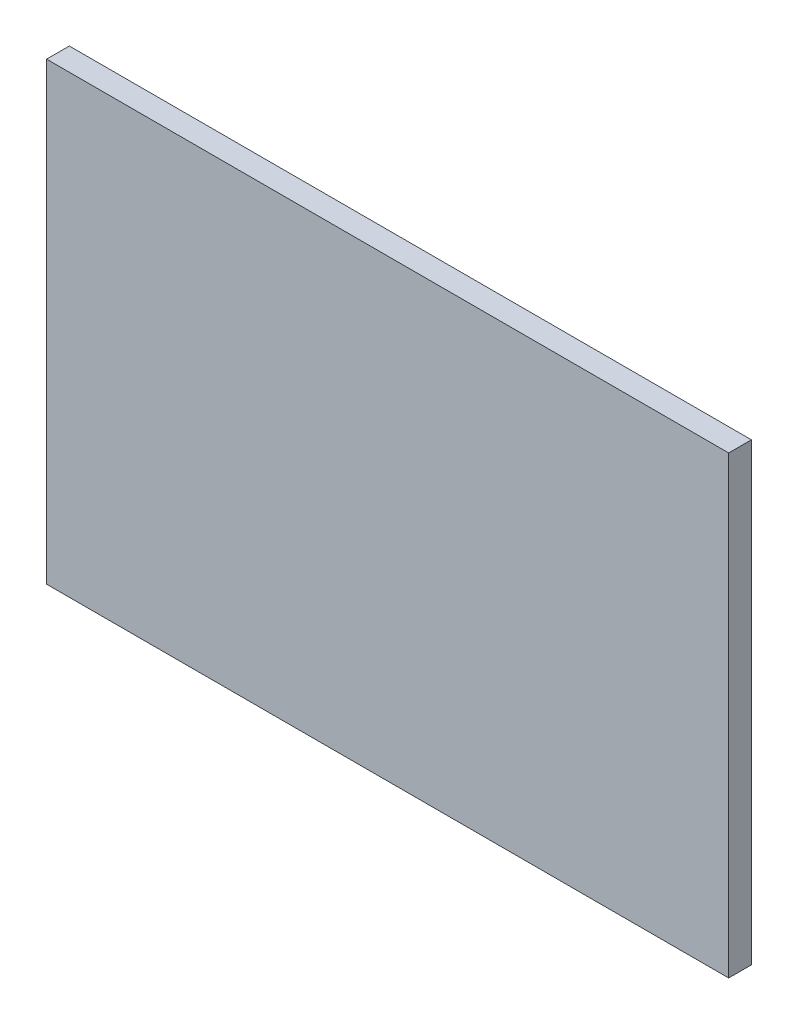
ISO-10303-21;
HEADER;
FILE_DESCRIPTION(('STEP AP214'),'2;1');
FILE_NAME('part.step','',(''),(''),'','','');
FILE_SCHEMA(('AUTOMOTIVE_DESIGN { 1 0 10303 214 1 1 1 1 }'));
ENDSEC;
DATA;
#1=APPLICATION_CONTEXT('core data for automotive mechanical design processes');
#2=APPLICATION_PROTOCOL_DEFINITION('international standard','automotive_design',2000,#1);
#3=PRODUCT_CONTEXT('',#1,'mechanical');
#4=PRODUCT('Part','Part','',(#3));
#5=PRODUCT_RELATED_PRODUCT_CATEGORY('part','',(#4));
#6=PRODUCT_DEFINITION_FORMATION('','',#4);
#7=PRODUCT_DEFINITION_CONTEXT('part definition',#1,'design');
#8=PRODUCT_DEFINITION('design','',#6,#7);
#9=PRODUCT_DEFINITION_SHAPE('','',#8);
#10=(LENGTH_UNIT() NAMED_UNIT(*) SI_UNIT(.MILLI.,.METRE.));
#11=(NAMED_UNIT(*) PLANE_ANGLE_UNIT() SI_UNIT($,.RADIAN.));
#12=(NAMED_UNIT(*) SI_UNIT($,.STERADIAN.) SOLID_ANGLE_UNIT());
#13=UNCERTAINTY_MEASURE_WITH_UNIT(LENGTH_MEASURE(1.E-05),#10,'distance_accuracy_value','');
#14=(GEOMETRIC_REPRESENTATION_CONTEXT(3) GLOBAL_UNCERTAINTY_ASSIGNED_CONTEXT((#13)) GLOBAL_UNIT_ASSIGNED_CONTEXT((#10,
#11,#12)) REPRESENTATION_CONTEXT('',''));
#15=CARTESIAN_POINT('',(0.,0.,0.));
#16=DIRECTION('',(0.,0.,1.));
#17=DIRECTION('',(1.,0.,0.));
#18=AXIS2_PLACEMENT_3D('',#15,#16,#17);
#19=CARTESIAN_POINT('',(-72.2025479526639,35.0321658778279,1.));
#20=DIRECTION('',(1.,0.,0.));
#21=DIRECTION('',(0.,0.,-1.));
#22=AXIS2_PLACEMENT_3D('',#19,#20,#21);
#23=PLANE('',#22);
#24=DIRECTION('',(0.,-1.,0.));
#25=VECTOR('',#24,1.);
#26=CARTESIAN_POINT('',(-72.2025479526639,35.0321658778279,0.));
#27=LINE('',#26,#25);
#28=CARTESIAN_POINT('',(-72.2025479526639,35.0321658778279,0.));
#29=VERTEX_POINT('',#28);
#30=CARTESIAN_POINT('',(-72.2025479526639,15.0321658778279,0.));
#31=VERTEX_POINT('',#30);
#32=EDGE_CURVE('E96',#29,#31,#27,.T.);
#33=ORIENTED_EDGE('',*,*,#32,.T.);
#34=DIRECTION('',(0.,0.,-1.));
#35=VECTOR('',#34,1.);
#36=CARTESIAN_POINT('',(-72.2025479526639,15.0321658778279,1.));
#37=LINE('',#36,#35);
#38=CARTESIAN_POINT('',(-72.2025479526639,15.0321658778279,1.));
#39=VERTEX_POINT('',#38);
#40=EDGE_CURVE('E11',#39,#31,#37,.T.);
#41=ORIENTED_EDGE('',*,*,#40,.F.);
#42=DIRECTION('',(0.,-1.,0.));
#43=VECTOR('',#42,1.);
#44=CARTESIAN_POINT('',(-72.2025479526639,35.0321658778279,1.));
#45=LINE('',#44,#43);
#46=CARTESIAN_POINT('',(-72.2025479526639,35.0321658778279,1.));
#47=VERTEX_POINT('',#46);
#48=EDGE_CURVE('E84',#47,#39,#45,.T.);
#49=ORIENTED_EDGE('',*,*,#48,.F.);
#50=DIRECTION('',(0.,0.,-1.));
#51=VECTOR('',#50,1.);
#52=CARTESIAN_POINT('',(-72.2025479526639,35.0321658778279,1.));
#53=LINE('',#52,#51);
#54=EDGE_CURVE('E92',#47,#29,#53,.T.);
#55=ORIENTED_EDGE('',*,*,#54,.T.);
#56=EDGE_LOOP('',(#33,#41,#49,#55));
#57=FACE_BOUND('',#56,.T.);
#58=ADVANCED_FACE('F33',(#57),#23,.F.);
#59=CARTESIAN_POINT('',(-72.2025479526639,15.0321658778279,1.));
#60=DIRECTION('',(0.,1.,0.));
#61=DIRECTION('',(0.,0.,1.));
#62=AXIS2_PLACEMENT_3D('',#59,#60,#61);
#63=PLANE('',#62);
#64=DIRECTION('',(1.,0.,0.));
#65=VECTOR('',#64,1.);
#66=CARTESIAN_POINT('',(-72.2025479526639,15.0321658778279,0.));
#67=LINE('',#66,#65);
#68=CARTESIAN_POINT('',(-42.2025479526639,15.0321658778279,0.));
#69=VERTEX_POINT('',#68);
#70=EDGE_CURVE('E88',#31,#69,#67,.T.);
#71=ORIENTED_EDGE('',*,*,#70,.T.);
#72=DIRECTION('',(0.,0.,-1.));
#73=VECTOR('',#72,1.);
#74=CARTESIAN_POINT('',(-42.2025479526639,15.0321658778279,1.));
#75=LINE('',#74,#73);
#76=CARTESIAN_POINT('',(-42.2025479526639,15.0321658778279,1.));
#77=VERTEX_POINT('',#76);
#78=EDGE_CURVE('E41',#77,#69,#75,.T.);
#79=ORIENTED_EDGE('',*,*,#78,.F.);
#80=DIRECTION('',(1.,0.,0.));
#81=VECTOR('',#80,1.);
#82=CARTESIAN_POINT('',(-72.2025479526639,15.0321658778279,1.));
#83=LINE('',#82,#81);
#84=EDGE_CURVE('E79',#39,#77,#83,.T.);
#85=ORIENTED_EDGE('',*,*,#84,.F.);
#86=ORIENTED_EDGE('',*,*,#40,.T.);
#87=EDGE_LOOP('',(#71,#79,#85,#86));
#88=FACE_BOUND('',#87,.T.);
#89=ADVANCED_FACE('F87',(#88),#63,.F.);
#90=CARTESIAN_POINT('',(-42.2025479526639,35.0321658778279,1.));
#91=DIRECTION('',(-1.,0.,0.));
#92=DIRECTION('',(0.,0.,1.));
#93=AXIS2_PLACEMENT_3D('',#90,#91,#92);
#94=PLANE('',#93);
#95=DIRECTION('',(0.,1.,0.));
#96=VECTOR('',#95,1.);
#97=CARTESIAN_POINT('',(-42.2025479526639,35.0321658778279,0.));
#98=LINE('',#97,#96);
#99=CARTESIAN_POINT('',(-42.2025479526639,35.0321658778279,0.));
#100=VERTEX_POINT('',#99);
#101=EDGE_CURVE('E66',#69,#100,#98,.T.);
#102=ORIENTED_EDGE('',*,*,#101,.T.);
#103=DIRECTION('',(0.,0.,-1.));
#104=VECTOR('',#103,1.);
#105=CARTESIAN_POINT('',(-42.2025479526639,35.0321658778279,1.));
#106=LINE('',#105,#104);
#107=CARTESIAN_POINT('',(-42.2025479526639,35.0321658778279,1.));
#108=VERTEX_POINT('',#107);
#109=EDGE_CURVE('E89',#108,#100,#106,.T.);
#110=ORIENTED_EDGE('',*,*,#109,.F.);
#111=DIRECTION('',(0.,1.,0.));
#112=VECTOR('',#111,1.);
#113=CARTESIAN_POINT('',(-42.2025479526639,35.0321658778279,1.));
#114=LINE('',#113,#112);
#115=EDGE_CURVE('E82',#77,#108,#114,.T.);
#116=ORIENTED_EDGE('',*,*,#115,.F.);
#117=ORIENTED_EDGE('',*,*,#78,.T.);
#118=EDGE_LOOP('',(#102,#110,#116,#117));
#119=FACE_BOUND('',#118,.T.);
#120=ADVANCED_FACE('F90',(#119),#94,.F.);
#121=CARTESIAN_POINT('',(-72.2025479526639,35.0321658778279,1.));
#122=DIRECTION('',(0.,-1.,0.));
#123=DIRECTION('',(0.,0.,-1.));
#124=AXIS2_PLACEMENT_3D('',#121,#122,#123);
#125=PLANE('',#124);
#126=DIRECTION('',(-1.,0.,0.));
#127=VECTOR('',#126,1.);
#128=CARTESIAN_POINT('',(-72.2025479526639,35.0321658778279,0.));
#129=LINE('',#128,#127);
#130=EDGE_CURVE('E72',#100,#29,#129,.T.);
#131=ORIENTED_EDGE('',*,*,#130,.T.);
#132=ORIENTED_EDGE('',*,*,#54,.F.);
#133=DIRECTION('',(-1.,0.,0.));
#134=VECTOR('',#133,1.);
#135=CARTESIAN_POINT('',(-72.2025479526639,35.0321658778279,1.));
#136=LINE('',#135,#134);
#137=EDGE_CURVE('E49',#108,#47,#136,.T.);
#138=ORIENTED_EDGE('',*,*,#137,.F.);
#139=ORIENTED_EDGE('',*,*,#109,.T.);
#140=EDGE_LOOP('',(#131,#132,#138,#139));
#141=FACE_BOUND('',#140,.T.);
#142=ADVANCED_FACE('F103',(#141),#125,.F.);
#143=CARTESIAN_POINT('',(0.,0.,1.));
#144=DIRECTION('',(0.,0.,1.));
#145=DIRECTION('',(1.,0.,0.));
#146=AXIS2_PLACEMENT_3D('',#143,#144,#145);
#147=PLANE('',#146);
#148=ORIENTED_EDGE('',*,*,#48,.T.);
#149=ORIENTED_EDGE('',*,*,#84,.T.);
#150=ORIENTED_EDGE('',*,*,#115,.T.);
#151=ORIENTED_EDGE('',*,*,#137,.T.);
#152=EDGE_LOOP('',(#148,#149,#150,#151));
#153=FACE_BOUND('',#152,.T.);
#154=ADVANCED_FACE('F80',(#153),#147,.T.);
#155=CARTESIAN_POINT('',(0.,0.,0.));
#156=DIRECTION('',(0.,0.,1.));
#157=DIRECTION('',(1.,0.,0.));
#158=AXIS2_PLACEMENT_3D('',#155,#156,#157);
#159=PLANE('',#158);
#160=ORIENTED_EDGE('',*,*,#32,.F.);
#161=ORIENTED_EDGE('',*,*,#130,.F.);
#162=ORIENTED_EDGE('',*,*,#101,.F.);
#163=ORIENTED_EDGE('',*,*,#70,.F.);
#164=EDGE_LOOP('',(#160,#161,#162,#163));
#165=FACE_BOUND('',#164,.T.);
#166=ADVANCED_FACE('F106',(#165),#159,.F.);
#167=CLOSED_SHELL('',(#58,#89,#120,#142,#154,#166));
#168=MANIFOLD_SOLID_BREP('B2',#167);
#169=ADVANCED_BREP_SHAPE_REPRESENTATION('',(#18,#168),#14);
#170=SHAPE_DEFINITION_REPRESENTATION(#9,#169);
ENDSEC;
END-ISO-10303-21;
